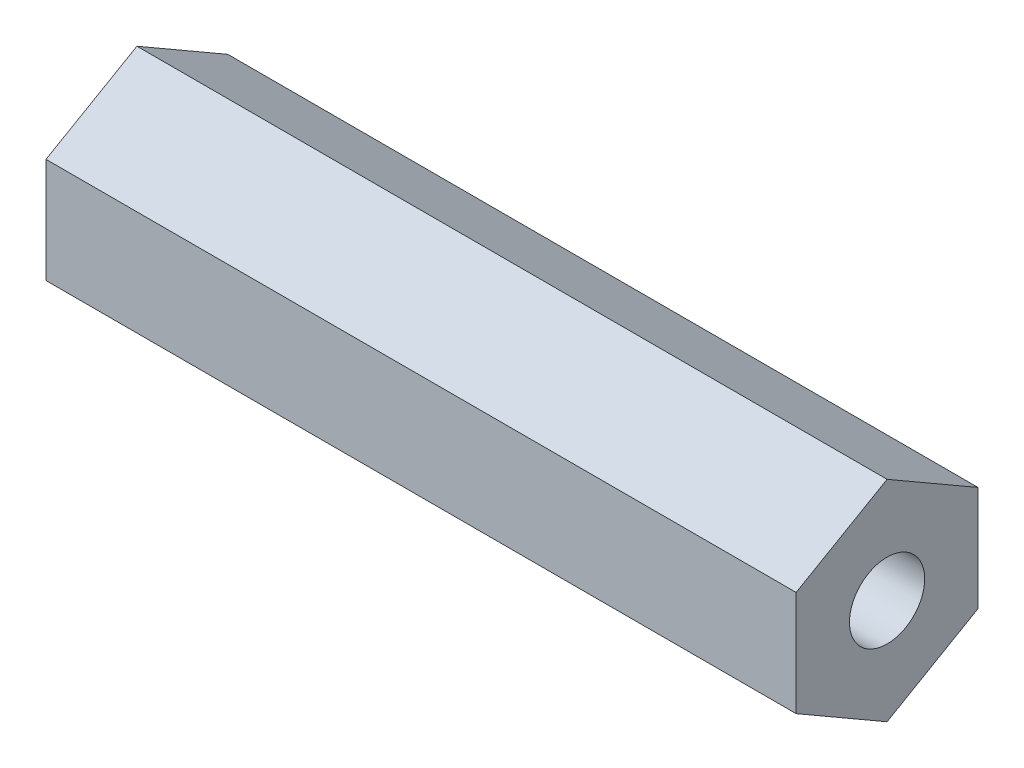
ISO-10303-21;
HEADER;
FILE_DESCRIPTION(('STEP AP214'),'2;1');
FILE_NAME('part.step','',(''),(''),'','','');
FILE_SCHEMA(('AUTOMOTIVE_DESIGN { 1 0 10303 214 1 1 1 1 }'));
ENDSEC;
DATA;
#1=APPLICATION_CONTEXT('core data for automotive mechanical design processes');
#2=APPLICATION_PROTOCOL_DEFINITION('international standard','automotive_design',2000,#1);
#3=PRODUCT_CONTEXT('',#1,'mechanical');
#4=PRODUCT('Part','Part','',(#3));
#5=PRODUCT_RELATED_PRODUCT_CATEGORY('part','',(#4));
#6=PRODUCT_DEFINITION_FORMATION('','',#4);
#7=PRODUCT_DEFINITION_CONTEXT('part definition',#1,'design');
#8=PRODUCT_DEFINITION('design','',#6,#7);
#9=PRODUCT_DEFINITION_SHAPE('','',#8);
#10=(LENGTH_UNIT() NAMED_UNIT(*) SI_UNIT(.MILLI.,.METRE.));
#11=(NAMED_UNIT(*) PLANE_ANGLE_UNIT() SI_UNIT($,.RADIAN.));
#12=(NAMED_UNIT(*) SI_UNIT($,.STERADIAN.) SOLID_ANGLE_UNIT());
#13=UNCERTAINTY_MEASURE_WITH_UNIT(LENGTH_MEASURE(1.E-05),#10,'distance_accuracy_value','');
#14=(GEOMETRIC_REPRESENTATION_CONTEXT(3) GLOBAL_UNCERTAINTY_ASSIGNED_CONTEXT((#13)) GLOBAL_UNIT_ASSIGNED_CONTEXT((#10,
#11,#12)) REPRESENTATION_CONTEXT('',''));
#15=CARTESIAN_POINT('',(0.,0.,0.));
#16=DIRECTION('',(0.,0.,1.));
#17=DIRECTION('',(1.,0.,0.));
#18=AXIS2_PLACEMENT_3D('',#15,#16,#17);
#19=CARTESIAN_POINT('',(52.3875,0.,0.));
#20=DIRECTION('',(1.,0.,0.));
#21=DIRECTION('',(0.,0.,-1.));
#22=AXIS2_PLACEMENT_3D('',#19,#20,#21);
#23=PLANE('',#22);
#24=DIRECTION('',(0.,0.499999999999999,0.866025403784439));
#25=VECTOR('',#24,1.);
#26=CARTESIAN_POINT('',(52.3875,3.66617420935412,-6.35));
#27=LINE('',#26,#25);
#28=CARTESIAN_POINT('',(52.3875,3.66617420935412,-6.35));
#29=VERTEX_POINT('',#28);
#30=CARTESIAN_POINT('',(52.3875,7.33234841870824,0.));
#31=VERTEX_POINT('',#30);
#32=EDGE_CURVE('E132',#29,#31,#27,.T.);
#33=ORIENTED_EDGE('',*,*,#32,.T.);
#34=DIRECTION('',(0.,-0.5,0.866025403784438));
#35=VECTOR('',#34,1.);
#36=CARTESIAN_POINT('',(52.3875,7.33234841870824,0.));
#37=LINE('',#36,#35);
#38=CARTESIAN_POINT('',(52.3875,3.66617420935412,6.35));
#39=VERTEX_POINT('',#38);
#40=EDGE_CURVE('E90',#31,#39,#37,.T.);
#41=ORIENTED_EDGE('',*,*,#40,.T.);
#42=DIRECTION('',(0.,-1.,0.));
#43=VECTOR('',#42,1.);
#44=CARTESIAN_POINT('',(52.3875,3.66617420935412,6.35));
#45=LINE('',#44,#43);
#46=CARTESIAN_POINT('',(52.3875,-3.66617420935413,6.35));
#47=VERTEX_POINT('',#46);
#48=EDGE_CURVE('E103',#39,#47,#45,.T.);
#49=ORIENTED_EDGE('',*,*,#48,.T.);
#50=DIRECTION('',(0.,-0.499999999999999,-0.866025403784439));
#51=VECTOR('',#50,1.);
#52=CARTESIAN_POINT('',(52.3875,-3.66617420935413,6.35));
#53=LINE('',#52,#51);
#54=CARTESIAN_POINT('',(52.3875,-7.33234841870825,0.));
#55=VERTEX_POINT('',#54);
#56=EDGE_CURVE('E97',#47,#55,#53,.T.);
#57=ORIENTED_EDGE('',*,*,#56,.T.);
#58=DIRECTION('',(0.,0.5,-0.866025403784438));
#59=VECTOR('',#58,1.);
#60=CARTESIAN_POINT('',(52.3875,-7.33234841870825,0.));
#61=LINE('',#60,#59);
#62=CARTESIAN_POINT('',(52.3875,-3.66617420935412,-6.35));
#63=VERTEX_POINT('',#62);
#64=EDGE_CURVE('E101',#55,#63,#61,.T.);
#65=ORIENTED_EDGE('',*,*,#64,.T.);
#66=DIRECTION('',(0.,1.,0.));
#67=VECTOR('',#66,1.);
#68=CARTESIAN_POINT('',(52.3875,-3.66617420935412,-6.35));
#69=LINE('',#68,#67);
#70=EDGE_CURVE('E53',#63,#29,#69,.T.);
#71=ORIENTED_EDGE('',*,*,#70,.T.);
#72=EDGE_LOOP('',(#33,#41,#49,#57,#65,#71));
#73=FACE_BOUND('',#72,.T.);
#74=CARTESIAN_POINT('',(52.3875,0.,0.));
#75=DIRECTION('',(1.,0.,0.));
#76=DIRECTION('',(0.,0.,-1.));
#77=AXIS2_PLACEMENT_3D('',#74,#75,#76);
#78=CIRCLE('',#77,2.6289);
#79=CARTESIAN_POINT('',(52.3875,0.,-2.6289));
#80=VERTEX_POINT('',#79);
#81=EDGE_CURVE('E125',#80,#80,#78,.T.);
#82=ORIENTED_EDGE('',*,*,#81,.F.);
#83=EDGE_LOOP('',(#82));
#84=FACE_BOUND('',#83,.T.);
#85=ADVANCED_FACE('F36',(#73,#84),#23,.T.);
#86=CARTESIAN_POINT('',(0.,0.,0.));
#87=DIRECTION('',(1.,0.,0.));
#88=DIRECTION('',(0.,0.,-1.));
#89=AXIS2_PLACEMENT_3D('',#86,#87,#88);
#90=PLANE('',#89);
#91=DIRECTION('',(0.,0.499999999999999,0.866025403784439));
#92=VECTOR('',#91,1.);
#93=CARTESIAN_POINT('',(0.,3.66617420935412,-6.35));
#94=LINE('',#93,#92);
#95=CARTESIAN_POINT('',(0.,3.66617420935412,-6.35));
#96=VERTEX_POINT('',#95);
#97=CARTESIAN_POINT('',(0.,7.33234841870824,0.));
#98=VERTEX_POINT('',#97);
#99=EDGE_CURVE('E121',#96,#98,#94,.T.);
#100=ORIENTED_EDGE('',*,*,#99,.F.);
#101=DIRECTION('',(0.,1.,0.));
#102=VECTOR('',#101,1.);
#103=CARTESIAN_POINT('',(0.,-3.66617420935412,-6.35));
#104=LINE('',#103,#102);
#105=CARTESIAN_POINT('',(0.,-3.66617420935412,-6.35));
#106=VERTEX_POINT('',#105);
#107=EDGE_CURVE('E82',#106,#96,#104,.T.);
#108=ORIENTED_EDGE('',*,*,#107,.F.);
#109=DIRECTION('',(0.,0.5,-0.866025403784438));
#110=VECTOR('',#109,1.);
#111=CARTESIAN_POINT('',(0.,-7.33234841870825,0.));
#112=LINE('',#111,#110);
#113=CARTESIAN_POINT('',(0.,-7.33234841870825,0.));
#114=VERTEX_POINT('',#113);
#115=EDGE_CURVE('E76',#114,#106,#112,.T.);
#116=ORIENTED_EDGE('',*,*,#115,.F.);
#117=DIRECTION('',(0.,-0.499999999999999,-0.866025403784439));
#118=VECTOR('',#117,1.);
#119=CARTESIAN_POINT('',(0.,-3.66617420935413,6.35));
#120=LINE('',#119,#118);
#121=CARTESIAN_POINT('',(0.,-3.66617420935413,6.35));
#122=VERTEX_POINT('',#121);
#123=EDGE_CURVE('E111',#122,#114,#120,.T.);
#124=ORIENTED_EDGE('',*,*,#123,.F.);
#125=DIRECTION('',(0.,-1.,0.));
#126=VECTOR('',#125,1.);
#127=CARTESIAN_POINT('',(0.,3.66617420935412,6.35));
#128=LINE('',#127,#126);
#129=CARTESIAN_POINT('',(0.,3.66617420935412,6.35));
#130=VERTEX_POINT('',#129);
#131=EDGE_CURVE('E127',#130,#122,#128,.T.);
#132=ORIENTED_EDGE('',*,*,#131,.F.);
#133=DIRECTION('',(0.,-0.5,0.866025403784438));
#134=VECTOR('',#133,1.);
#135=CARTESIAN_POINT('',(0.,7.33234841870824,0.));
#136=LINE('',#135,#134);
#137=EDGE_CURVE('E124',#98,#130,#136,.T.);
#138=ORIENTED_EDGE('',*,*,#137,.F.);
#139=EDGE_LOOP('',(#100,#108,#116,#124,#132,#138));
#140=FACE_BOUND('',#139,.T.);
#141=CARTESIAN_POINT('',(0.,0.,0.));
#142=DIRECTION('',(1.,0.,0.));
#143=DIRECTION('',(0.,0.,-1.));
#144=AXIS2_PLACEMENT_3D('',#141,#142,#143);
#145=CIRCLE('',#144,2.6289);
#146=CARTESIAN_POINT('',(0.,0.,-2.6289));
#147=VERTEX_POINT('',#146);
#148=EDGE_CURVE('E225',#147,#147,#145,.T.);
#149=ORIENTED_EDGE('',*,*,#148,.T.);
#150=EDGE_LOOP('',(#149));
#151=FACE_BOUND('',#150,.T.);
#152=ADVANCED_FACE('F141',(#140,#151),#90,.F.);
#153=CARTESIAN_POINT('',(52.3875,3.66617420935412,-6.35));
#154=DIRECTION('',(0.,-0.866025403784439,0.499999999999999));
#155=DIRECTION('',(0.,-0.499999999999999,-0.866025403784439));
#156=AXIS2_PLACEMENT_3D('',#153,#154,#155);
#157=PLANE('',#156);
#158=ORIENTED_EDGE('',*,*,#99,.T.);
#159=DIRECTION('',(-1.,0.,0.));
#160=VECTOR('',#159,1.);
#161=CARTESIAN_POINT('',(52.3875,7.33234841870824,0.));
#162=LINE('',#161,#160);
#163=EDGE_CURVE('E11',#31,#98,#162,.T.);
#164=ORIENTED_EDGE('',*,*,#163,.F.);
#165=ORIENTED_EDGE('',*,*,#32,.F.);
#166=DIRECTION('',(-1.,0.,0.));
#167=VECTOR('',#166,1.);
#168=CARTESIAN_POINT('',(52.3875,3.66617420935412,-6.35));
#169=LINE('',#168,#167);
#170=EDGE_CURVE('E117',#29,#96,#169,.T.);
#171=ORIENTED_EDGE('',*,*,#170,.T.);
#172=EDGE_LOOP('',(#158,#164,#165,#171));
#173=FACE_BOUND('',#172,.T.);
#174=ADVANCED_FACE('F38',(#173),#157,.F.);
#175=CARTESIAN_POINT('',(52.3875,7.33234841870824,0.));
#176=DIRECTION('',(0.,-0.866025403784438,-0.5));
#177=DIRECTION('',(0.,0.5,-0.866025403784439));
#178=AXIS2_PLACEMENT_3D('',#175,#176,#177);
#179=PLANE('',#178);
#180=ORIENTED_EDGE('',*,*,#137,.T.);
#181=DIRECTION('',(-1.,0.,0.));
#182=VECTOR('',#181,1.);
#183=CARTESIAN_POINT('',(52.3875,3.66617420935412,6.35));
#184=LINE('',#183,#182);
#185=EDGE_CURVE('E45',#39,#130,#184,.T.);
#186=ORIENTED_EDGE('',*,*,#185,.F.);
#187=ORIENTED_EDGE('',*,*,#40,.F.);
#188=ORIENTED_EDGE('',*,*,#163,.T.);
#189=EDGE_LOOP('',(#180,#186,#187,#188));
#190=FACE_BOUND('',#189,.T.);
#191=ADVANCED_FACE('F166',(#190),#179,.F.);
#192=CARTESIAN_POINT('',(52.3875,3.66617420935412,6.35));
#193=DIRECTION('',(0.,0.,-1.));
#194=DIRECTION('',(0.,1.,0.));
#195=AXIS2_PLACEMENT_3D('',#192,#193,#194);
#196=PLANE('',#195);
#197=ORIENTED_EDGE('',*,*,#131,.T.);
#198=DIRECTION('',(-1.,0.,0.));
#199=VECTOR('',#198,1.);
#200=CARTESIAN_POINT('',(52.3875,-3.66617420935413,6.35));
#201=LINE('',#200,#199);
#202=EDGE_CURVE('E112',#47,#122,#201,.T.);
#203=ORIENTED_EDGE('',*,*,#202,.F.);
#204=ORIENTED_EDGE('',*,*,#48,.F.);
#205=ORIENTED_EDGE('',*,*,#185,.T.);
#206=EDGE_LOOP('',(#197,#203,#204,#205));
#207=FACE_BOUND('',#206,.T.);
#208=ADVANCED_FACE('F138',(#207),#196,.F.);
#209=CARTESIAN_POINT('',(52.3875,-3.66617420935413,6.35));
#210=DIRECTION('',(0.,0.866025403784439,-0.499999999999999));
#211=DIRECTION('',(0.,0.5,0.866025403784439));
#212=AXIS2_PLACEMENT_3D('',#209,#210,#211);
#213=PLANE('',#212);
#214=ORIENTED_EDGE('',*,*,#123,.T.);
#215=DIRECTION('',(-1.,0.,0.));
#216=VECTOR('',#215,1.);
#217=CARTESIAN_POINT('',(52.3875,-7.33234841870825,0.));
#218=LINE('',#217,#216);
#219=EDGE_CURVE('E108',#55,#114,#218,.T.);
#220=ORIENTED_EDGE('',*,*,#219,.F.);
#221=ORIENTED_EDGE('',*,*,#56,.F.);
#222=ORIENTED_EDGE('',*,*,#202,.T.);
#223=EDGE_LOOP('',(#214,#220,#221,#222));
#224=FACE_BOUND('',#223,.T.);
#225=ADVANCED_FACE('F109',(#224),#213,.F.);
#226=CARTESIAN_POINT('',(52.3875,-7.33234841870825,0.));
#227=DIRECTION('',(0.,0.866025403784438,0.5));
#228=DIRECTION('',(0.,-0.500000000000001,0.866025403784438));
#229=AXIS2_PLACEMENT_3D('',#226,#227,#228);
#230=PLANE('',#229);
#231=ORIENTED_EDGE('',*,*,#115,.T.);
#232=DIRECTION('',(-1.,0.,0.));
#233=VECTOR('',#232,1.);
#234=CARTESIAN_POINT('',(52.3875,-3.66617420935412,-6.35));
#235=LINE('',#234,#233);
#236=EDGE_CURVE('E113',#63,#106,#235,.T.);
#237=ORIENTED_EDGE('',*,*,#236,.F.);
#238=ORIENTED_EDGE('',*,*,#64,.F.);
#239=ORIENTED_EDGE('',*,*,#219,.T.);
#240=EDGE_LOOP('',(#231,#237,#238,#239));
#241=FACE_BOUND('',#240,.T.);
#242=ADVANCED_FACE('F115',(#241),#230,.F.);
#243=CARTESIAN_POINT('',(52.3875,-3.66617420935412,-6.35));
#244=DIRECTION('',(0.,0.,1.));
#245=DIRECTION('',(0.,-1.,0.));
#246=AXIS2_PLACEMENT_3D('',#243,#244,#245);
#247=PLANE('',#246);
#248=ORIENTED_EDGE('',*,*,#107,.T.);
#249=ORIENTED_EDGE('',*,*,#170,.F.);
#250=ORIENTED_EDGE('',*,*,#70,.F.);
#251=ORIENTED_EDGE('',*,*,#236,.T.);
#252=EDGE_LOOP('',(#248,#249,#250,#251));
#253=FACE_BOUND('',#252,.T.);
#254=ADVANCED_FACE('F146',(#253),#247,.F.);
#255=CARTESIAN_POINT('',(52.3875,0.,0.));
#256=DIRECTION('',(-1.,0.,0.));
#257=DIRECTION('',(0.,0.,1.));
#258=AXIS2_PLACEMENT_3D('',#255,#256,#257);
#259=CYLINDRICAL_SURFACE('',#258,2.6289);
#260=ORIENTED_EDGE('',*,*,#81,.T.);
#261=EDGE_LOOP('',(#260));
#262=FACE_BOUND('',#261,.T.);
#263=ORIENTED_EDGE('',*,*,#148,.F.);
#264=EDGE_LOOP('',(#263));
#265=FACE_BOUND('',#264,.T.);
#266=ADVANCED_FACE('F148',(#262,#265),#259,.F.);
#267=CLOSED_SHELL('',(#85,#152,#174,#191,#208,#225,#242,#254,#266));
#268=MANIFOLD_SOLID_BREP('B2',#267);
#269=ADVANCED_BREP_SHAPE_REPRESENTATION('',(#18,#268),#14);
#270=SHAPE_DEFINITION_REPRESENTATION(#9,#269);
ENDSEC;
END-ISO-10303-21;
